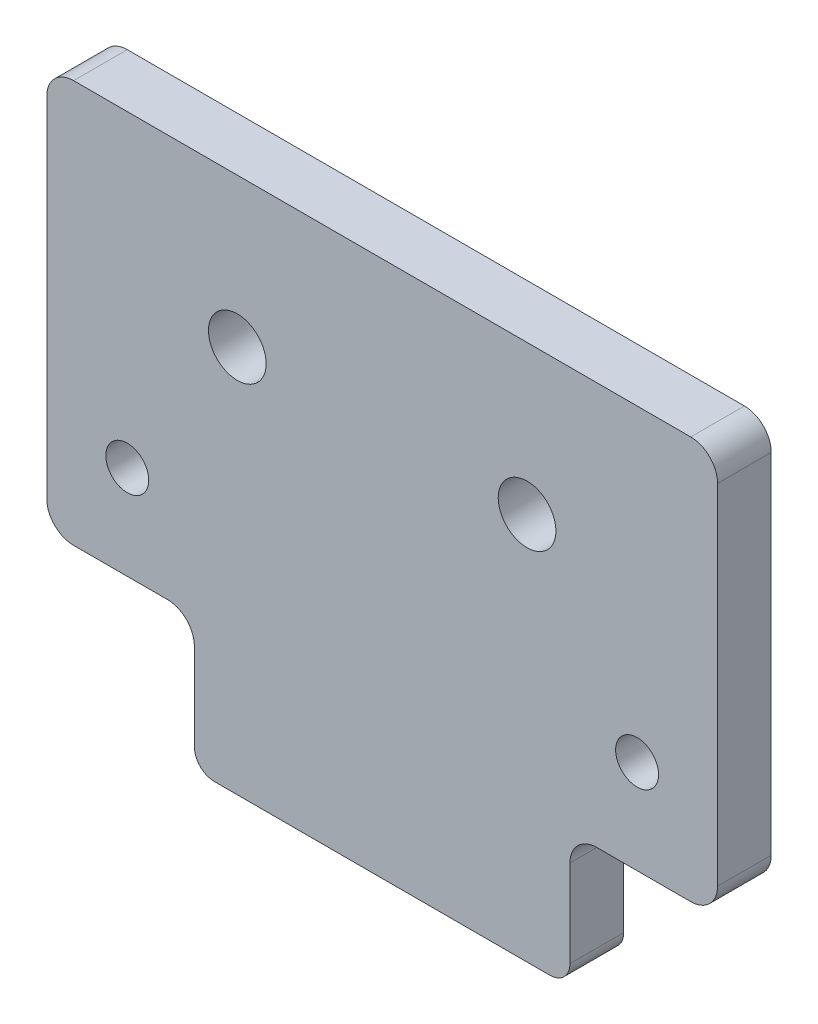
ISO-10303-21;
HEADER;
FILE_DESCRIPTION(('STEP AP214'),'2;1');
FILE_NAME('part.step','',(''),(''),'','','');
FILE_SCHEMA(('AUTOMOTIVE_DESIGN { 1 0 10303 214 1 1 1 1 }'));
ENDSEC;
DATA;
#1=APPLICATION_CONTEXT('core data for automotive mechanical design processes');
#2=APPLICATION_PROTOCOL_DEFINITION('international standard','automotive_design',2000,#1);
#3=PRODUCT_CONTEXT('',#1,'mechanical');
#4=PRODUCT('Part','Part','',(#3));
#5=PRODUCT_RELATED_PRODUCT_CATEGORY('part','',(#4));
#6=PRODUCT_DEFINITION_FORMATION('','',#4);
#7=PRODUCT_DEFINITION_CONTEXT('part definition',#1,'design');
#8=PRODUCT_DEFINITION('design','',#6,#7);
#9=PRODUCT_DEFINITION_SHAPE('','',#8);
#10=(LENGTH_UNIT() NAMED_UNIT(*) SI_UNIT(.MILLI.,.METRE.));
#11=(NAMED_UNIT(*) PLANE_ANGLE_UNIT() SI_UNIT($,.RADIAN.));
#12=(NAMED_UNIT(*) SI_UNIT($,.STERADIAN.) SOLID_ANGLE_UNIT());
#13=UNCERTAINTY_MEASURE_WITH_UNIT(LENGTH_MEASURE(1.E-05),#10,'distance_accuracy_value','');
#14=(GEOMETRIC_REPRESENTATION_CONTEXT(3) GLOBAL_UNCERTAINTY_ASSIGNED_CONTEXT((#13)) GLOBAL_UNIT_ASSIGNED_CONTEXT((#10,
#11,#12)) REPRESENTATION_CONTEXT('',''));
#15=CARTESIAN_POINT('',(0.,0.,0.));
#16=DIRECTION('',(0.,0.,1.));
#17=DIRECTION('',(1.,0.,0.));
#18=AXIS2_PLACEMENT_3D('',#15,#16,#17);
#19=CARTESIAN_POINT('',(0.,0.,4.));
#20=DIRECTION('',(0.,1.,0.));
#21=DIRECTION('',(0.,0.,1.));
#22=AXIS2_PLACEMENT_3D('',#19,#20,#21);
#23=PLANE('',#22);
#24=DIRECTION('',(1.,0.,0.));
#25=VECTOR('',#24,1.);
#26=CARTESIAN_POINT('',(0.,0.,0.));
#27=LINE('',#26,#25);
#28=CARTESIAN_POINT('',(41.,0.,0.));
#29=VERTEX_POINT('',#28);
#30=CARTESIAN_POINT('',(48.,0.,0.));
#31=VERTEX_POINT('',#30);
#32=EDGE_CURVE('E266',#29,#31,#27,.T.);
#33=ORIENTED_EDGE('',*,*,#32,.T.);
#34=DIRECTION('',(0.,0.,-1.));
#35=VECTOR('',#34,1.);
#36=CARTESIAN_POINT('',(48.,0.,4.));
#37=LINE('',#36,#35);
#38=CARTESIAN_POINT('',(48.,0.,4.));
#39=VERTEX_POINT('',#38);
#40=EDGE_CURVE('E213',#31,#39,#37,.F.);
#41=ORIENTED_EDGE('',*,*,#40,.T.);
#42=DIRECTION('',(1.,0.,0.));
#43=VECTOR('',#42,1.);
#44=CARTESIAN_POINT('',(0.,0.,4.));
#45=LINE('',#44,#43);
#46=CARTESIAN_POINT('',(41.,0.,4.));
#47=VERTEX_POINT('',#46);
#48=EDGE_CURVE('E247',#47,#39,#45,.T.);
#49=ORIENTED_EDGE('',*,*,#48,.F.);
#50=DIRECTION('',(0.,0.,1.));
#51=VECTOR('',#50,1.);
#52=CARTESIAN_POINT('',(41.,0.,4.));
#53=LINE('',#52,#51);
#54=EDGE_CURVE('E211',#47,#29,#53,.F.);
#55=ORIENTED_EDGE('',*,*,#54,.T.);
#56=EDGE_LOOP('',(#33,#41,#49,#55));
#57=FACE_BOUND('',#56,.T.);
#58=ADVANCED_FACE('F38',(#57),#23,.F.);
#59=CARTESIAN_POINT('',(0.,0.,4.));
#60=DIRECTION('',(1.,0.,0.));
#61=DIRECTION('',(0.,0.,-1.));
#62=AXIS2_PLACEMENT_3D('',#59,#60,#61);
#63=PLANE('',#62);
#64=DIRECTION('',(0.,-1.,0.));
#65=VECTOR('',#64,1.);
#66=CARTESIAN_POINT('',(0.,0.,4.));
#67=LINE('',#66,#65);
#68=CARTESIAN_POINT('',(0.,28.,4.));
#69=VERTEX_POINT('',#68);
#70=CARTESIAN_POINT('',(0.,2.,4.));
#71=VERTEX_POINT('',#70);
#72=EDGE_CURVE('E259',#69,#71,#67,.T.);
#73=ORIENTED_EDGE('',*,*,#72,.F.);
#74=DIRECTION('',(0.,0.,-1.));
#75=VECTOR('',#74,1.);
#76=CARTESIAN_POINT('',(0.,28.,4.));
#77=LINE('',#76,#75);
#78=CARTESIAN_POINT('',(0.,28.,0.));
#79=VERTEX_POINT('',#78);
#80=EDGE_CURVE('E229',#69,#79,#77,.T.);
#81=ORIENTED_EDGE('',*,*,#80,.T.);
#82=DIRECTION('',(0.,-1.,0.));
#83=VECTOR('',#82,1.);
#84=CARTESIAN_POINT('',(0.,0.,0.));
#85=LINE('',#84,#83);
#86=CARTESIAN_POINT('',(0.,2.,0.));
#87=VERTEX_POINT('',#86);
#88=EDGE_CURVE('E291',#79,#87,#85,.T.);
#89=ORIENTED_EDGE('',*,*,#88,.T.);
#90=DIRECTION('',(0.,0.,-1.));
#91=VECTOR('',#90,1.);
#92=CARTESIAN_POINT('',(0.,2.,4.));
#93=LINE('',#92,#91);
#94=EDGE_CURVE('E227',#87,#71,#93,.F.);
#95=ORIENTED_EDGE('',*,*,#94,.T.);
#96=EDGE_LOOP('',(#73,#81,#89,#95));
#97=FACE_BOUND('',#96,.T.);
#98=ADVANCED_FACE('F327',(#97),#63,.F.);
#99=CARTESIAN_POINT('',(2.,0.,4.));
#100=VERTEX_POINT('',#99);
#101=CARTESIAN_POINT('',(9.00000000000001,0.,4.));
#102=VERTEX_POINT('',#101);
#103=EDGE_CURVE('E258',#100,#102,#45,.T.);
#104=ORIENTED_EDGE('',*,*,#103,.F.);
#105=DIRECTION('',(0.,0.,-1.));
#106=VECTOR('',#105,1.);
#107=CARTESIAN_POINT('',(2.,0.,4.));
#108=LINE('',#107,#106);
#109=CARTESIAN_POINT('',(2.,0.,0.));
#110=VERTEX_POINT('',#109);
#111=EDGE_CURVE('E234',#100,#110,#108,.T.);
#112=ORIENTED_EDGE('',*,*,#111,.T.);
#113=CARTESIAN_POINT('',(9.00000000000001,0.,0.));
#114=VERTEX_POINT('',#113);
#115=EDGE_CURVE('E305',#110,#114,#27,.T.);
#116=ORIENTED_EDGE('',*,*,#115,.T.);
#117=DIRECTION('',(0.,0.,1.));
#118=VECTOR('',#117,1.);
#119=CARTESIAN_POINT('',(9.00000000000001,0.,4.));
#120=LINE('',#119,#118);
#121=EDGE_CURVE('E232',#114,#102,#120,.T.);
#122=ORIENTED_EDGE('',*,*,#121,.T.);
#123=EDGE_LOOP('',(#104,#112,#116,#122));
#124=FACE_BOUND('',#123,.T.);
#125=ADVANCED_FACE('F314',(#124),#23,.F.);
#126=CARTESIAN_POINT('',(50.,0.,4.));
#127=DIRECTION('',(-1.,0.,0.));
#128=DIRECTION('',(0.,0.,1.));
#129=AXIS2_PLACEMENT_3D('',#126,#127,#128);
#130=PLANE('',#129);
#131=DIRECTION('',(0.,1.,0.));
#132=VECTOR('',#131,1.);
#133=CARTESIAN_POINT('',(50.,0.,4.));
#134=LINE('',#133,#132);
#135=CARTESIAN_POINT('',(50.,2.,4.));
#136=VERTEX_POINT('',#135);
#137=CARTESIAN_POINT('',(50.,28.,4.));
#138=VERTEX_POINT('',#137);
#139=EDGE_CURVE('E184',#136,#138,#134,.T.);
#140=ORIENTED_EDGE('',*,*,#139,.F.);
#141=DIRECTION('',(0.,0.,-1.));
#142=VECTOR('',#141,1.);
#143=CARTESIAN_POINT('',(50.,2.,4.));
#144=LINE('',#143,#142);
#145=CARTESIAN_POINT('',(50.,2.,0.));
#146=VERTEX_POINT('',#145);
#147=EDGE_CURVE('E200',#136,#146,#144,.T.);
#148=ORIENTED_EDGE('',*,*,#147,.T.);
#149=DIRECTION('',(0.,1.,0.));
#150=VECTOR('',#149,1.);
#151=CARTESIAN_POINT('',(50.,0.,0.));
#152=LINE('',#151,#150);
#153=CARTESIAN_POINT('',(50.,28.,0.));
#154=VERTEX_POINT('',#153);
#155=EDGE_CURVE('E306',#146,#154,#152,.T.);
#156=ORIENTED_EDGE('',*,*,#155,.T.);
#157=DIRECTION('',(0.,0.,-1.));
#158=VECTOR('',#157,1.);
#159=CARTESIAN_POINT('',(50.,28.,4.));
#160=LINE('',#159,#158);
#161=EDGE_CURVE('E198',#154,#138,#160,.F.);
#162=ORIENTED_EDGE('',*,*,#161,.T.);
#163=EDGE_LOOP('',(#140,#148,#156,#162));
#164=FACE_BOUND('',#163,.T.);
#165=ADVANCED_FACE('F336',(#164),#130,.F.);
#166=CARTESIAN_POINT('',(0.,30.,4.));
#167=DIRECTION('',(0.,-1.,0.));
#168=DIRECTION('',(0.,0.,-1.));
#169=AXIS2_PLACEMENT_3D('',#166,#167,#168);
#170=PLANE('',#169);
#171=DIRECTION('',(-1.,0.,0.));
#172=VECTOR('',#171,1.);
#173=CARTESIAN_POINT('',(0.,30.,4.));
#174=LINE('',#173,#172);
#175=CARTESIAN_POINT('',(48.,30.,4.));
#176=VERTEX_POINT('',#175);
#177=CARTESIAN_POINT('',(2.,30.,4.));
#178=VERTEX_POINT('',#177);
#179=EDGE_CURVE('E180',#176,#178,#174,.T.);
#180=ORIENTED_EDGE('',*,*,#179,.F.);
#181=DIRECTION('',(0.,0.,-1.));
#182=VECTOR('',#181,1.);
#183=CARTESIAN_POINT('',(48.,30.,4.));
#184=LINE('',#183,#182);
#185=CARTESIAN_POINT('',(48.,30.,0.));
#186=VERTEX_POINT('',#185);
#187=EDGE_CURVE('E224',#176,#186,#184,.T.);
#188=ORIENTED_EDGE('',*,*,#187,.T.);
#189=DIRECTION('',(-1.,0.,0.));
#190=VECTOR('',#189,1.);
#191=CARTESIAN_POINT('',(0.,30.,0.));
#192=LINE('',#191,#190);
#193=CARTESIAN_POINT('',(2.,30.,0.));
#194=VERTEX_POINT('',#193);
#195=EDGE_CURVE('E187',#186,#194,#192,.T.);
#196=ORIENTED_EDGE('',*,*,#195,.T.);
#197=DIRECTION('',(0.,0.,-1.));
#198=VECTOR('',#197,1.);
#199=CARTESIAN_POINT('',(2.,30.,4.));
#200=LINE('',#199,#198);
#201=EDGE_CURVE('E222',#194,#178,#200,.F.);
#202=ORIENTED_EDGE('',*,*,#201,.T.);
#203=EDGE_LOOP('',(#180,#188,#196,#202));
#204=FACE_BOUND('',#203,.T.);
#205=ADVANCED_FACE('F340',(#204),#170,.F.);
#206=CARTESIAN_POINT('',(0.,0.,4.));
#207=DIRECTION('',(0.,0.,-1.));
#208=DIRECTION('',(-1.,0.,0.));
#209=AXIS2_PLACEMENT_3D('',#206,#207,#208);
#210=PLANE('',#209);
#211=CARTESIAN_POINT('',(43.9999999999999,6.99999999999999,4.));
#212=DIRECTION('',(0.,0.,1.));
#213=DIRECTION('',(1.,0.,0.));
#214=AXIS2_PLACEMENT_3D('',#211,#212,#213);
#215=CIRCLE('',#214,1.6);
#216=CARTESIAN_POINT('',(45.5999999999999,6.99999999999999,4.));
#217=VERTEX_POINT('',#216);
#218=EDGE_CURVE('E283',#217,#217,#215,.T.);
#219=ORIENTED_EDGE('',*,*,#218,.F.);
#220=EDGE_LOOP('',(#219));
#221=FACE_BOUND('',#220,.T.);
#222=CARTESIAN_POINT('',(6.00000000000007,6.99999999999999,4.));
#223=DIRECTION('',(0.,0.,1.));
#224=DIRECTION('',(-1.,0.,0.));
#225=AXIS2_PLACEMENT_3D('',#222,#223,#224);
#226=CIRCLE('',#225,1.6);
#227=CARTESIAN_POINT('',(4.40000000000007,6.99999999999999,4.));
#228=VERTEX_POINT('',#227);
#229=EDGE_CURVE('E270',#228,#228,#226,.T.);
#230=ORIENTED_EDGE('',*,*,#229,.F.);
#231=EDGE_LOOP('',(#230));
#232=FACE_BOUND('',#231,.T.);
#233=CARTESIAN_POINT('',(14.2,18.9,4.));
#234=DIRECTION('',(0.,0.,1.));
#235=DIRECTION('',(1.,0.,0.));
#236=AXIS2_PLACEMENT_3D('',#233,#234,#235);
#237=CIRCLE('',#236,2.15);
#238=CARTESIAN_POINT('',(16.35,18.9,4.));
#239=VERTEX_POINT('',#238);
#240=EDGE_CURVE('E292',#239,#239,#237,.T.);
#241=ORIENTED_EDGE('',*,*,#240,.F.);
#242=EDGE_LOOP('',(#241));
#243=FACE_BOUND('',#242,.T.);
#244=CARTESIAN_POINT('',(35.8,18.9,4.));
#245=DIRECTION('',(0.,0.,1.));
#246=DIRECTION('',(-1.,0.,0.));
#247=AXIS2_PLACEMENT_3D('',#244,#245,#246);
#248=CIRCLE('',#247,2.15);
#249=CARTESIAN_POINT('',(33.65,18.9,4.));
#250=VERTEX_POINT('',#249);
#251=EDGE_CURVE('E282',#250,#250,#248,.T.);
#252=ORIENTED_EDGE('',*,*,#251,.F.);
#253=EDGE_LOOP('',(#252));
#254=FACE_BOUND('',#253,.T.);
#255=ORIENTED_EDGE('',*,*,#48,.T.);
#256=CARTESIAN_POINT('',(48.,2.,4.));
#257=DIRECTION('',(0.,0.,-1.));
#258=DIRECTION('',(-1.,0.,0.));
#259=AXIS2_PLACEMENT_3D('',#256,#257,#258);
#260=CIRCLE('',#259,2.);
#261=EDGE_CURVE('E220',#39,#136,#260,.F.);
#262=ORIENTED_EDGE('',*,*,#261,.T.);
#263=ORIENTED_EDGE('',*,*,#139,.T.);
#264=CARTESIAN_POINT('',(48.,28.,4.));
#265=DIRECTION('',(0.,0.,-1.));
#266=DIRECTION('',(-1.,0.,0.));
#267=AXIS2_PLACEMENT_3D('',#264,#265,#266);
#268=CIRCLE('',#267,2.);
#269=EDGE_CURVE('E218',#138,#176,#268,.F.);
#270=ORIENTED_EDGE('',*,*,#269,.T.);
#271=ORIENTED_EDGE('',*,*,#179,.T.);
#272=CARTESIAN_POINT('',(2.,28.,4.));
#273=DIRECTION('',(0.,0.,-1.));
#274=DIRECTION('',(-1.,0.,0.));
#275=AXIS2_PLACEMENT_3D('',#272,#273,#274);
#276=CIRCLE('',#275,2.);
#277=EDGE_CURVE('E216',#178,#69,#276,.F.);
#278=ORIENTED_EDGE('',*,*,#277,.T.);
#279=ORIENTED_EDGE('',*,*,#72,.T.);
#280=CARTESIAN_POINT('',(2.,2.,4.));
#281=DIRECTION('',(0.,0.,-1.));
#282=DIRECTION('',(-1.,0.,0.));
#283=AXIS2_PLACEMENT_3D('',#280,#281,#282);
#284=CIRCLE('',#283,2.);
#285=EDGE_CURVE('E61',#71,#100,#284,.F.);
#286=ORIENTED_EDGE('',*,*,#285,.T.);
#287=ORIENTED_EDGE('',*,*,#103,.T.);
#288=CARTESIAN_POINT('',(9.00000000000001,-2.,4.));
#289=DIRECTION('',(0.,0.,-1.));
#290=DIRECTION('',(-1.,0.,0.));
#291=AXIS2_PLACEMENT_3D('',#288,#289,#290);
#292=CIRCLE('',#291,2.);
#293=CARTESIAN_POINT('',(11.,-2.,4.));
#294=VERTEX_POINT('',#293);
#295=EDGE_CURVE('E53',#102,#294,#292,.T.);
#296=ORIENTED_EDGE('',*,*,#295,.T.);
#297=DIRECTION('',(0.,-1.,0.));
#298=VECTOR('',#297,1.);
#299=CARTESIAN_POINT('',(11.,0.,4.));
#300=LINE('',#299,#298);
#301=CARTESIAN_POINT('',(11.,-8.5,4.));
#302=VERTEX_POINT('',#301);
#303=EDGE_CURVE('E538',#294,#302,#300,.T.);
#304=ORIENTED_EDGE('',*,*,#303,.T.);
#305=CARTESIAN_POINT('',(12.5,-8.5,4.));
#306=DIRECTION('',(0.,0.,-1.));
#307=DIRECTION('',(-1.,0.,0.));
#308=AXIS2_PLACEMENT_3D('',#305,#306,#307);
#309=CIRCLE('',#308,1.5);
#310=CARTESIAN_POINT('',(12.5,-10.,4.));
#311=VERTEX_POINT('',#310);
#312=EDGE_CURVE('E178',#302,#311,#309,.F.);
#313=ORIENTED_EDGE('',*,*,#312,.T.);
#314=DIRECTION('',(1.,0.,0.));
#315=VECTOR('',#314,1.);
#316=CARTESIAN_POINT('',(39.,-10.,4.));
#317=LINE('',#316,#315);
#318=CARTESIAN_POINT('',(37.5,-10.,4.));
#319=VERTEX_POINT('',#318);
#320=EDGE_CURVE('E163',#311,#319,#317,.T.);
#321=ORIENTED_EDGE('',*,*,#320,.T.);
#322=CARTESIAN_POINT('',(37.5,-8.5,4.));
#323=DIRECTION('',(0.,0.,-1.));
#324=DIRECTION('',(-1.,0.,0.));
#325=AXIS2_PLACEMENT_3D('',#322,#323,#324);
#326=CIRCLE('',#325,1.5);
#327=CARTESIAN_POINT('',(39.,-8.5,4.));
#328=VERTEX_POINT('',#327);
#329=EDGE_CURVE('E179',#319,#328,#326,.F.);
#330=ORIENTED_EDGE('',*,*,#329,.T.);
#331=DIRECTION('',(0.,1.,0.));
#332=VECTOR('',#331,1.);
#333=CARTESIAN_POINT('',(39.,0.,4.));
#334=LINE('',#333,#332);
#335=CARTESIAN_POINT('',(39.,-2.,4.));
#336=VERTEX_POINT('',#335);
#337=EDGE_CURVE('E250',#328,#336,#334,.T.);
#338=ORIENTED_EDGE('',*,*,#337,.T.);
#339=CARTESIAN_POINT('',(41.,-2.,4.));
#340=DIRECTION('',(0.,0.,-1.));
#341=DIRECTION('',(-1.,0.,0.));
#342=AXIS2_PLACEMENT_3D('',#339,#340,#341);
#343=CIRCLE('',#342,2.);
#344=EDGE_CURVE('E46',#336,#47,#343,.T.);
#345=ORIENTED_EDGE('',*,*,#344,.T.);
#346=EDGE_LOOP('',(#255,#262,#263,#270,#271,#278,#279,#286,#287,#296,#304,#313,#321,#330,#338,#345));
#347=FACE_BOUND('',#346,.T.);
#348=ADVANCED_FACE('F246',(#221,#232,#243,#254,#347),#210,.F.);
#349=CARTESIAN_POINT('',(0.,0.,0.));
#350=DIRECTION('',(0.,0.,-1.));
#351=DIRECTION('',(-1.,0.,0.));
#352=AXIS2_PLACEMENT_3D('',#349,#350,#351);
#353=PLANE('',#352);
#354=CARTESIAN_POINT('',(43.9999999999999,6.99999999999999,0.));
#355=DIRECTION('',(0.,0.,1.));
#356=DIRECTION('',(1.,0.,0.));
#357=AXIS2_PLACEMENT_3D('',#354,#355,#356);
#358=CIRCLE('',#357,1.6);
#359=CARTESIAN_POINT('',(45.5999999999999,6.99999999999999,0.));
#360=VERTEX_POINT('',#359);
#361=EDGE_CURVE('E279',#360,#360,#358,.T.);
#362=ORIENTED_EDGE('',*,*,#361,.T.);
#363=EDGE_LOOP('',(#362));
#364=FACE_BOUND('',#363,.T.);
#365=CARTESIAN_POINT('',(6.00000000000007,6.99999999999999,0.));
#366=DIRECTION('',(0.,0.,1.));
#367=DIRECTION('',(-1.,0.,0.));
#368=AXIS2_PLACEMENT_3D('',#365,#366,#367);
#369=CIRCLE('',#368,1.6);
#370=CARTESIAN_POINT('',(4.40000000000007,6.99999999999999,0.));
#371=VERTEX_POINT('',#370);
#372=EDGE_CURVE('E273',#371,#371,#369,.T.);
#373=ORIENTED_EDGE('',*,*,#372,.T.);
#374=EDGE_LOOP('',(#373));
#375=FACE_BOUND('',#374,.T.);
#376=CARTESIAN_POINT('',(14.2,18.9,0.));
#377=DIRECTION('',(0.,0.,1.));
#378=DIRECTION('',(1.,0.,0.));
#379=AXIS2_PLACEMENT_3D('',#376,#377,#378);
#380=CIRCLE('',#379,2.15);
#381=CARTESIAN_POINT('',(16.35,18.9,0.));
#382=VERTEX_POINT('',#381);
#383=EDGE_CURVE('E288',#382,#382,#380,.T.);
#384=ORIENTED_EDGE('',*,*,#383,.T.);
#385=EDGE_LOOP('',(#384));
#386=FACE_BOUND('',#385,.T.);
#387=CARTESIAN_POINT('',(35.8,18.9,0.));
#388=DIRECTION('',(0.,0.,1.));
#389=DIRECTION('',(-1.,0.,0.));
#390=AXIS2_PLACEMENT_3D('',#387,#388,#389);
#391=CIRCLE('',#390,2.15);
#392=CARTESIAN_POINT('',(33.65,18.9,0.));
#393=VERTEX_POINT('',#392);
#394=EDGE_CURVE('E295',#393,#393,#391,.T.);
#395=ORIENTED_EDGE('',*,*,#394,.T.);
#396=EDGE_LOOP('',(#395));
#397=FACE_BOUND('',#396,.T.);
#398=ORIENTED_EDGE('',*,*,#155,.F.);
#399=CARTESIAN_POINT('',(48.,2.,0.));
#400=DIRECTION('',(0.,0.,-1.));
#401=DIRECTION('',(-1.,0.,0.));
#402=AXIS2_PLACEMENT_3D('',#399,#400,#401);
#403=CIRCLE('',#402,2.);
#404=EDGE_CURVE('E209',#146,#31,#403,.T.);
#405=ORIENTED_EDGE('',*,*,#404,.T.);
#406=ORIENTED_EDGE('',*,*,#32,.F.);
#407=CARTESIAN_POINT('',(41.,-2.,0.));
#408=DIRECTION('',(0.,0.,-1.));
#409=DIRECTION('',(-1.,0.,0.));
#410=AXIS2_PLACEMENT_3D('',#407,#408,#409);
#411=CIRCLE('',#410,2.);
#412=CARTESIAN_POINT('',(39.,-2.,0.));
#413=VERTEX_POINT('',#412);
#414=EDGE_CURVE('E11',#29,#413,#411,.F.);
#415=ORIENTED_EDGE('',*,*,#414,.T.);
#416=DIRECTION('',(0.,1.,0.));
#417=VECTOR('',#416,1.);
#418=CARTESIAN_POINT('',(39.,0.,0.));
#419=LINE('',#418,#417);
#420=CARTESIAN_POINT('',(39.,-8.5,0.));
#421=VERTEX_POINT('',#420);
#422=EDGE_CURVE('E264',#421,#413,#419,.T.);
#423=ORIENTED_EDGE('',*,*,#422,.F.);
#424=CARTESIAN_POINT('',(37.5,-8.5,0.));
#425=DIRECTION('',(0.,0.,-1.));
#426=DIRECTION('',(-1.,0.,0.));
#427=AXIS2_PLACEMENT_3D('',#424,#425,#426);
#428=CIRCLE('',#427,1.5);
#429=CARTESIAN_POINT('',(37.5,-10.,0.));
#430=VERTEX_POINT('',#429);
#431=EDGE_CURVE('E174',#421,#430,#428,.T.);
#432=ORIENTED_EDGE('',*,*,#431,.T.);
#433=DIRECTION('',(1.,0.,0.));
#434=VECTOR('',#433,1.);
#435=CARTESIAN_POINT('',(39.,-10.,0.));
#436=LINE('',#435,#434);
#437=CARTESIAN_POINT('',(12.5,-10.,0.));
#438=VERTEX_POINT('',#437);
#439=EDGE_CURVE('E162',#438,#430,#436,.T.);
#440=ORIENTED_EDGE('',*,*,#439,.F.);
#441=CARTESIAN_POINT('',(12.5,-8.5,0.));
#442=DIRECTION('',(0.,0.,-1.));
#443=DIRECTION('',(-1.,0.,0.));
#444=AXIS2_PLACEMENT_3D('',#441,#442,#443);
#445=CIRCLE('',#444,1.5);
#446=CARTESIAN_POINT('',(11.,-8.5,0.));
#447=VERTEX_POINT('',#446);
#448=EDGE_CURVE('E167',#438,#447,#445,.T.);
#449=ORIENTED_EDGE('',*,*,#448,.T.);
#450=DIRECTION('',(0.,-1.,0.));
#451=VECTOR('',#450,1.);
#452=CARTESIAN_POINT('',(11.,0.,0.));
#453=LINE('',#452,#451);
#454=CARTESIAN_POINT('',(11.,-2.,0.));
#455=VERTEX_POINT('',#454);
#456=EDGE_CURVE('E153',#455,#447,#453,.T.);
#457=ORIENTED_EDGE('',*,*,#456,.F.);
#458=CARTESIAN_POINT('',(9.00000000000001,-2.,0.));
#459=DIRECTION('',(0.,0.,-1.));
#460=DIRECTION('',(-1.,0.,0.));
#461=AXIS2_PLACEMENT_3D('',#458,#459,#460);
#462=CIRCLE('',#461,2.);
#463=EDGE_CURVE('E242',#455,#114,#462,.F.);
#464=ORIENTED_EDGE('',*,*,#463,.T.);
#465=ORIENTED_EDGE('',*,*,#115,.F.);
#466=CARTESIAN_POINT('',(2.,2.,0.));
#467=DIRECTION('',(0.,0.,-1.));
#468=DIRECTION('',(-1.,0.,0.));
#469=AXIS2_PLACEMENT_3D('',#466,#467,#468);
#470=CIRCLE('',#469,2.);
#471=EDGE_CURVE('E203',#110,#87,#470,.T.);
#472=ORIENTED_EDGE('',*,*,#471,.T.);
#473=ORIENTED_EDGE('',*,*,#88,.F.);
#474=CARTESIAN_POINT('',(2.,28.,0.));
#475=DIRECTION('',(0.,0.,-1.));
#476=DIRECTION('',(-1.,0.,0.));
#477=AXIS2_PLACEMENT_3D('',#474,#475,#476);
#478=CIRCLE('',#477,2.);
#479=EDGE_CURVE('E205',#79,#194,#478,.T.);
#480=ORIENTED_EDGE('',*,*,#479,.T.);
#481=ORIENTED_EDGE('',*,*,#195,.F.);
#482=CARTESIAN_POINT('',(48.,28.,0.));
#483=DIRECTION('',(0.,0.,-1.));
#484=DIRECTION('',(-1.,0.,0.));
#485=AXIS2_PLACEMENT_3D('',#482,#483,#484);
#486=CIRCLE('',#485,2.);
#487=EDGE_CURVE('E207',#186,#154,#486,.T.);
#488=ORIENTED_EDGE('',*,*,#487,.T.);
#489=EDGE_LOOP('',(#398,#405,#406,#415,#423,#432,#440,#449,#457,#464,#465,#472,#473,#480,#481,#488));
#490=FACE_BOUND('',#489,.T.);
#491=ADVANCED_FACE('F169',(#364,#375,#386,#397,#490),#353,.T.);
#492=CARTESIAN_POINT('',(35.8,18.9,0.));
#493=DIRECTION('',(0.,0.,1.));
#494=DIRECTION('',(1.,0.,0.));
#495=AXIS2_PLACEMENT_3D('',#492,#493,#494);
#496=CYLINDRICAL_SURFACE('',#495,2.15);
#497=ORIENTED_EDGE('',*,*,#394,.F.);
#498=EDGE_LOOP('',(#497));
#499=FACE_BOUND('',#498,.T.);
#500=ORIENTED_EDGE('',*,*,#251,.T.);
#501=EDGE_LOOP('',(#500));
#502=FACE_BOUND('',#501,.T.);
#503=ADVANCED_FACE('F350',(#499,#502),#496,.F.);
#504=CARTESIAN_POINT('',(14.2,18.9,0.));
#505=DIRECTION('',(0.,0.,1.));
#506=DIRECTION('',(1.,0.,0.));
#507=AXIS2_PLACEMENT_3D('',#504,#505,#506);
#508=CYLINDRICAL_SURFACE('',#507,2.15);
#509=ORIENTED_EDGE('',*,*,#383,.F.);
#510=EDGE_LOOP('',(#509));
#511=FACE_BOUND('',#510,.T.);
#512=ORIENTED_EDGE('',*,*,#240,.T.);
#513=EDGE_LOOP('',(#512));
#514=FACE_BOUND('',#513,.T.);
#515=ADVANCED_FACE('F357',(#511,#514),#508,.F.);
#516=CARTESIAN_POINT('',(6.00000000000007,6.99999999999999,0.));
#517=DIRECTION('',(0.,0.,1.));
#518=DIRECTION('',(1.,0.,0.));
#519=AXIS2_PLACEMENT_3D('',#516,#517,#518);
#520=CYLINDRICAL_SURFACE('',#519,1.6);
#521=ORIENTED_EDGE('',*,*,#372,.F.);
#522=EDGE_LOOP('',(#521));
#523=FACE_BOUND('',#522,.T.);
#524=ORIENTED_EDGE('',*,*,#229,.T.);
#525=EDGE_LOOP('',(#524));
#526=FACE_BOUND('',#525,.T.);
#527=ADVANCED_FACE('F361',(#523,#526),#520,.F.);
#528=CARTESIAN_POINT('',(43.9999999999999,6.99999999999999,0.));
#529=DIRECTION('',(0.,0.,1.));
#530=DIRECTION('',(1.,0.,0.));
#531=AXIS2_PLACEMENT_3D('',#528,#529,#530);
#532=CYLINDRICAL_SURFACE('',#531,1.6);
#533=ORIENTED_EDGE('',*,*,#361,.F.);
#534=EDGE_LOOP('',(#533));
#535=FACE_BOUND('',#534,.T.);
#536=ORIENTED_EDGE('',*,*,#218,.T.);
#537=EDGE_LOOP('',(#536));
#538=FACE_BOUND('',#537,.T.);
#539=ADVANCED_FACE('F365',(#535,#538),#532,.F.);
#540=CARTESIAN_POINT('',(11.,0.,-29.732137494637));
#541=DIRECTION('',(-1.,0.,0.));
#542=DIRECTION('',(0.,0.,1.));
#543=AXIS2_PLACEMENT_3D('',#540,#541,#542);
#544=PLANE('',#543);
#545=ORIENTED_EDGE('',*,*,#303,.F.);
#546=DIRECTION('',(0.,0.,1.));
#547=VECTOR('',#546,1.);
#548=CARTESIAN_POINT('',(11.,-2.,-29.732137494637));
#549=LINE('',#548,#547);
#550=EDGE_CURVE('E159',#294,#455,#549,.F.);
#551=ORIENTED_EDGE('',*,*,#550,.T.);
#552=ORIENTED_EDGE('',*,*,#456,.T.);
#553=DIRECTION('',(0.,0.,1.));
#554=VECTOR('',#553,1.);
#555=CARTESIAN_POINT('',(11.,-8.5,-29.732137494637));
#556=LINE('',#555,#554);
#557=EDGE_CURVE('E158',#447,#302,#556,.T.);
#558=ORIENTED_EDGE('',*,*,#557,.T.);
#559=EDGE_LOOP('',(#545,#551,#552,#558));
#560=FACE_BOUND('',#559,.T.);
#561=ADVANCED_FACE('F156',(#560),#544,.T.);
#562=CARTESIAN_POINT('',(39.,-10.,-29.732137494637));
#563=DIRECTION('',(0.,-1.,0.));
#564=DIRECTION('',(1.,0.,0.));
#565=AXIS2_PLACEMENT_3D('',#562,#563,#564);
#566=PLANE('',#565);
#567=ORIENTED_EDGE('',*,*,#320,.F.);
#568=DIRECTION('',(0.,0.,1.));
#569=VECTOR('',#568,1.);
#570=CARTESIAN_POINT('',(12.5,-10.,-29.732137494637));
#571=LINE('',#570,#569);
#572=EDGE_CURVE('E194',#311,#438,#571,.F.);
#573=ORIENTED_EDGE('',*,*,#572,.T.);
#574=ORIENTED_EDGE('',*,*,#439,.T.);
#575=DIRECTION('',(0.,0.,1.));
#576=VECTOR('',#575,1.);
#577=CARTESIAN_POINT('',(37.5,-10.,-29.732137494637));
#578=LINE('',#577,#576);
#579=EDGE_CURVE('E191',#430,#319,#578,.T.);
#580=ORIENTED_EDGE('',*,*,#579,.T.);
#581=EDGE_LOOP('',(#567,#573,#574,#580));
#582=FACE_BOUND('',#581,.T.);
#583=ADVANCED_FACE('F372',(#582),#566,.T.);
#584=CARTESIAN_POINT('',(39.,0.,-29.732137494637));
#585=DIRECTION('',(1.,0.,0.));
#586=DIRECTION('',(0.,1.,0.));
#587=AXIS2_PLACEMENT_3D('',#584,#585,#586);
#588=PLANE('',#587);
#589=ORIENTED_EDGE('',*,*,#422,.T.);
#590=DIRECTION('',(0.,0.,1.));
#591=VECTOR('',#590,1.);
#592=CARTESIAN_POINT('',(39.,-2.,-29.732137494637));
#593=LINE('',#592,#591);
#594=EDGE_CURVE('E238',#413,#336,#593,.T.);
#595=ORIENTED_EDGE('',*,*,#594,.T.);
#596=ORIENTED_EDGE('',*,*,#337,.F.);
#597=DIRECTION('',(0.,0.,1.));
#598=VECTOR('',#597,1.);
#599=CARTESIAN_POINT('',(39.,-8.5,-29.732137494637));
#600=LINE('',#599,#598);
#601=EDGE_CURVE('E173',#328,#421,#600,.F.);
#602=ORIENTED_EDGE('',*,*,#601,.T.);
#603=EDGE_LOOP('',(#589,#595,#596,#602));
#604=FACE_BOUND('',#603,.T.);
#605=ADVANCED_FACE('F268',(#604),#588,.T.);
#606=CARTESIAN_POINT('',(12.5,-8.5,-29.732137494637));
#607=DIRECTION('',(0.,0.,1.));
#608=DIRECTION('',(1.,0.,0.));
#609=AXIS2_PLACEMENT_3D('',#606,#607,#608);
#610=CYLINDRICAL_SURFACE('',#609,1.5);
#611=ORIENTED_EDGE('',*,*,#448,.F.);
#612=ORIENTED_EDGE('',*,*,#572,.F.);
#613=ORIENTED_EDGE('',*,*,#312,.F.);
#614=ORIENTED_EDGE('',*,*,#557,.F.);
#615=EDGE_LOOP('',(#611,#612,#613,#614));
#616=FACE_BOUND('',#615,.T.);
#617=ADVANCED_FACE('F177',(#616),#610,.T.);
#618=CARTESIAN_POINT('',(37.5,-8.5,-29.732137494637));
#619=DIRECTION('',(0.,0.,1.));
#620=DIRECTION('',(1.,0.,0.));
#621=AXIS2_PLACEMENT_3D('',#618,#619,#620);
#622=CYLINDRICAL_SURFACE('',#621,1.5);
#623=ORIENTED_EDGE('',*,*,#431,.F.);
#624=ORIENTED_EDGE('',*,*,#601,.F.);
#625=ORIENTED_EDGE('',*,*,#329,.F.);
#626=ORIENTED_EDGE('',*,*,#579,.F.);
#627=EDGE_LOOP('',(#623,#624,#625,#626));
#628=FACE_BOUND('',#627,.T.);
#629=ADVANCED_FACE('F380',(#628),#622,.T.);
#630=CARTESIAN_POINT('',(48.,2.,4.));
#631=DIRECTION('',(0.,0.,-1.));
#632=DIRECTION('',(-1.,0.,0.));
#633=AXIS2_PLACEMENT_3D('',#630,#631,#632);
#634=CYLINDRICAL_SURFACE('',#633,2.);
#635=ORIENTED_EDGE('',*,*,#261,.F.);
#636=ORIENTED_EDGE('',*,*,#40,.F.);
#637=ORIENTED_EDGE('',*,*,#404,.F.);
#638=ORIENTED_EDGE('',*,*,#147,.F.);
#639=EDGE_LOOP('',(#635,#636,#637,#638));
#640=FACE_BOUND('',#639,.T.);
#641=ADVANCED_FACE('F385',(#640),#634,.T.);
#642=CARTESIAN_POINT('',(48.,28.,4.));
#643=DIRECTION('',(0.,0.,-1.));
#644=DIRECTION('',(-1.,0.,0.));
#645=AXIS2_PLACEMENT_3D('',#642,#643,#644);
#646=CYLINDRICAL_SURFACE('',#645,2.);
#647=ORIENTED_EDGE('',*,*,#269,.F.);
#648=ORIENTED_EDGE('',*,*,#161,.F.);
#649=ORIENTED_EDGE('',*,*,#487,.F.);
#650=ORIENTED_EDGE('',*,*,#187,.F.);
#651=EDGE_LOOP('',(#647,#648,#649,#650));
#652=FACE_BOUND('',#651,.T.);
#653=ADVANCED_FACE('F391',(#652),#646,.T.);
#654=CARTESIAN_POINT('',(2.,28.,4.));
#655=DIRECTION('',(0.,0.,-1.));
#656=DIRECTION('',(-1.,0.,0.));
#657=AXIS2_PLACEMENT_3D('',#654,#655,#656);
#658=CYLINDRICAL_SURFACE('',#657,2.);
#659=ORIENTED_EDGE('',*,*,#277,.F.);
#660=ORIENTED_EDGE('',*,*,#201,.F.);
#661=ORIENTED_EDGE('',*,*,#479,.F.);
#662=ORIENTED_EDGE('',*,*,#80,.F.);
#663=EDGE_LOOP('',(#659,#660,#661,#662));
#664=FACE_BOUND('',#663,.T.);
#665=ADVANCED_FACE('F323',(#664),#658,.T.);
#666=CARTESIAN_POINT('',(2.,2.,4.));
#667=DIRECTION('',(0.,0.,-1.));
#668=DIRECTION('',(-1.,0.,0.));
#669=AXIS2_PLACEMENT_3D('',#666,#667,#668);
#670=CYLINDRICAL_SURFACE('',#669,2.);
#671=ORIENTED_EDGE('',*,*,#285,.F.);
#672=ORIENTED_EDGE('',*,*,#94,.F.);
#673=ORIENTED_EDGE('',*,*,#471,.F.);
#674=ORIENTED_EDGE('',*,*,#111,.F.);
#675=EDGE_LOOP('',(#671,#672,#673,#674));
#676=FACE_BOUND('',#675,.T.);
#677=ADVANCED_FACE('F318',(#676),#670,.T.);
#678=CARTESIAN_POINT('',(9.00000000000001,-2.,4.));
#679=DIRECTION('',(0.,0.,1.));
#680=DIRECTION('',(1.,0.,0.));
#681=AXIS2_PLACEMENT_3D('',#678,#679,#680);
#682=CYLINDRICAL_SURFACE('',#681,2.);
#683=ORIENTED_EDGE('',*,*,#463,.F.);
#684=ORIENTED_EDGE('',*,*,#550,.F.);
#685=ORIENTED_EDGE('',*,*,#295,.F.);
#686=ORIENTED_EDGE('',*,*,#121,.F.);
#687=EDGE_LOOP('',(#683,#684,#685,#686));
#688=FACE_BOUND('',#687,.T.);
#689=ADVANCED_FACE('F316',(#688),#682,.F.);
#690=CARTESIAN_POINT('',(41.,-2.,-29.732137494637));
#691=DIRECTION('',(0.,0.,1.));
#692=DIRECTION('',(1.,0.,0.));
#693=AXIS2_PLACEMENT_3D('',#690,#691,#692);
#694=CYLINDRICAL_SURFACE('',#693,2.);
#695=ORIENTED_EDGE('',*,*,#414,.F.);
#696=ORIENTED_EDGE('',*,*,#54,.F.);
#697=ORIENTED_EDGE('',*,*,#344,.F.);
#698=ORIENTED_EDGE('',*,*,#594,.F.);
#699=EDGE_LOOP('',(#695,#696,#697,#698));
#700=FACE_BOUND('',#699,.T.);
#701=ADVANCED_FACE('F40',(#700),#694,.F.);
#702=CLOSED_SHELL('',(#58,#98,#125,#165,#205,#348,#491,#503,#515,#527,#539,#561,#583,#605,#617,
#629,#641,#653,#665,#677,#689,#701));
#703=MANIFOLD_SOLID_BREP('B2',#702);
#704=ADVANCED_BREP_SHAPE_REPRESENTATION('',(#18,#703),#14);
#705=SHAPE_DEFINITION_REPRESENTATION(#9,#704);
ENDSEC;
END-ISO-10303-21;
